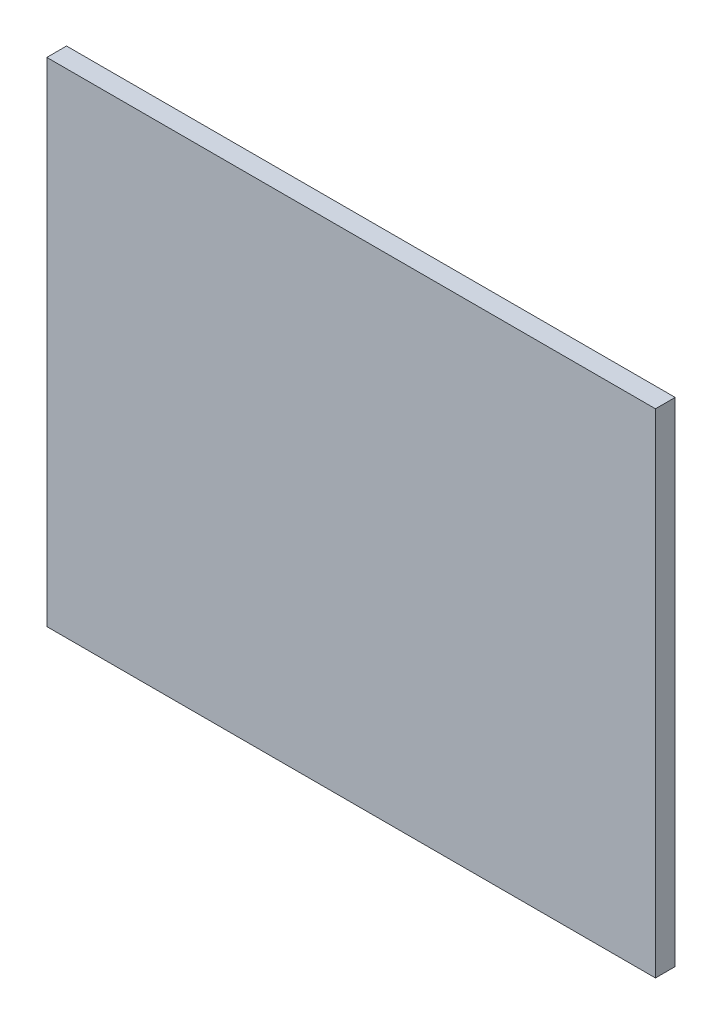
ISO-10303-21;
HEADER;
FILE_DESCRIPTION(('STEP AP214'),'2;1');
FILE_NAME('part.step','',(''),(''),'','','');
FILE_SCHEMA(('AUTOMOTIVE_DESIGN { 1 0 10303 214 1 1 1 1 }'));
ENDSEC;
DATA;
#1=APPLICATION_CONTEXT('core data for automotive mechanical design processes');
#2=APPLICATION_PROTOCOL_DEFINITION('international standard','automotive_design',2000,#1);
#3=PRODUCT_CONTEXT('',#1,'mechanical');
#4=PRODUCT('Part','Part','',(#3));
#5=PRODUCT_RELATED_PRODUCT_CATEGORY('part','',(#4));
#6=PRODUCT_DEFINITION_FORMATION('','',#4);
#7=PRODUCT_DEFINITION_CONTEXT('part definition',#1,'design');
#8=PRODUCT_DEFINITION('design','',#6,#7);
#9=PRODUCT_DEFINITION_SHAPE('','',#8);
#10=(LENGTH_UNIT() NAMED_UNIT(*) SI_UNIT(.MILLI.,.METRE.));
#11=(NAMED_UNIT(*) PLANE_ANGLE_UNIT() SI_UNIT($,.RADIAN.));
#12=(NAMED_UNIT(*) SI_UNIT($,.STERADIAN.) SOLID_ANGLE_UNIT());
#13=UNCERTAINTY_MEASURE_WITH_UNIT(LENGTH_MEASURE(1.E-05),#10,'distance_accuracy_value','');
#14=(GEOMETRIC_REPRESENTATION_CONTEXT(3) GLOBAL_UNCERTAINTY_ASSIGNED_CONTEXT((#13)) GLOBAL_UNIT_ASSIGNED_CONTEXT((#10,
#11,#12)) REPRESENTATION_CONTEXT('',''));
#15=CARTESIAN_POINT('',(0.,0.,0.));
#16=DIRECTION('',(0.,0.,1.));
#17=DIRECTION('',(1.,0.,0.));
#18=AXIS2_PLACEMENT_3D('',#15,#16,#17);
#19=CARTESIAN_POINT('',(-19.2882891651094,18.3076374413829,1.5));
#20=DIRECTION('',(1.,0.,0.));
#21=DIRECTION('',(0.,1.,0.));
#22=AXIS2_PLACEMENT_3D('',#19,#20,#21);
#23=PLANE('',#22);
#24=DIRECTION('',(0.,-1.,0.));
#25=VECTOR('',#24,1.);
#26=CARTESIAN_POINT('',(-19.2882891651094,18.3076374413829,0.));
#27=LINE('',#26,#25);
#28=CARTESIAN_POINT('',(-19.2882891651094,18.3076374413829,0.));
#29=VERTEX_POINT('',#28);
#30=CARTESIAN_POINT('',(-19.2882891651094,-19.1923625586171,0.));
#31=VERTEX_POINT('',#30);
#32=EDGE_CURVE('E98',#29,#31,#27,.T.);
#33=ORIENTED_EDGE('',*,*,#32,.T.);
#34=DIRECTION('',(0.,0.,-1.));
#35=VECTOR('',#34,1.);
#36=CARTESIAN_POINT('',(-19.2882891651094,-19.1923625586171,1.5));
#37=LINE('',#36,#35);
#38=CARTESIAN_POINT('',(-19.2882891651094,-19.1923625586171,1.5));
#39=VERTEX_POINT('',#38);
#40=EDGE_CURVE('E11',#39,#31,#37,.T.);
#41=ORIENTED_EDGE('',*,*,#40,.F.);
#42=DIRECTION('',(0.,-1.,0.));
#43=VECTOR('',#42,1.);
#44=CARTESIAN_POINT('',(-19.2882891651094,18.3076374413829,1.5));
#45=LINE('',#44,#43);
#46=CARTESIAN_POINT('',(-19.2882891651094,18.3076374413829,1.5));
#47=VERTEX_POINT('',#46);
#48=EDGE_CURVE('E86',#47,#39,#45,.T.);
#49=ORIENTED_EDGE('',*,*,#48,.F.);
#50=DIRECTION('',(0.,0.,-1.));
#51=VECTOR('',#50,1.);
#52=CARTESIAN_POINT('',(-19.2882891651094,18.3076374413829,1.5));
#53=LINE('',#52,#51);
#54=EDGE_CURVE('E94',#47,#29,#53,.T.);
#55=ORIENTED_EDGE('',*,*,#54,.T.);
#56=EDGE_LOOP('',(#33,#41,#49,#55));
#57=FACE_BOUND('',#56,.T.);
#58=ADVANCED_FACE('F35',(#57),#23,.F.);
#59=CARTESIAN_POINT('',(-19.2882891651094,-19.1923625586171,1.5));
#60=DIRECTION('',(0.,1.,0.));
#61=DIRECTION('',(-1.,0.,0.));
#62=AXIS2_PLACEMENT_3D('',#59,#60,#61);
#63=PLANE('',#62);
#64=DIRECTION('',(1.,0.,0.));
#65=VECTOR('',#64,1.);
#66=CARTESIAN_POINT('',(-19.2882891651094,-19.1923625586171,0.));
#67=LINE('',#66,#65);
#68=CARTESIAN_POINT('',(27.0117108348906,-19.1923625586171,0.));
#69=VERTEX_POINT('',#68);
#70=EDGE_CURVE('E90',#31,#69,#67,.T.);
#71=ORIENTED_EDGE('',*,*,#70,.T.);
#72=DIRECTION('',(0.,0.,-1.));
#73=VECTOR('',#72,1.);
#74=CARTESIAN_POINT('',(27.0117108348906,-19.1923625586171,1.5));
#75=LINE('',#74,#73);
#76=CARTESIAN_POINT('',(27.0117108348906,-19.1923625586171,1.5));
#77=VERTEX_POINT('',#76);
#78=EDGE_CURVE('E43',#77,#69,#75,.T.);
#79=ORIENTED_EDGE('',*,*,#78,.F.);
#80=DIRECTION('',(1.,0.,0.));
#81=VECTOR('',#80,1.);
#82=CARTESIAN_POINT('',(-19.2882891651094,-19.1923625586171,1.5));
#83=LINE('',#82,#81);
#84=EDGE_CURVE('E81',#39,#77,#83,.T.);
#85=ORIENTED_EDGE('',*,*,#84,.F.);
#86=ORIENTED_EDGE('',*,*,#40,.T.);
#87=EDGE_LOOP('',(#71,#79,#85,#86));
#88=FACE_BOUND('',#87,.T.);
#89=ADVANCED_FACE('F89',(#88),#63,.F.);
#90=CARTESIAN_POINT('',(27.0117108348906,18.3076374413829,1.5));
#91=DIRECTION('',(-1.,0.,0.));
#92=DIRECTION('',(0.,0.,1.));
#93=AXIS2_PLACEMENT_3D('',#90,#91,#92);
#94=PLANE('',#93);
#95=DIRECTION('',(0.,1.,0.));
#96=VECTOR('',#95,1.);
#97=CARTESIAN_POINT('',(27.0117108348906,18.3076374413829,0.));
#98=LINE('',#97,#96);
#99=CARTESIAN_POINT('',(27.0117108348906,18.3076374413829,0.));
#100=VERTEX_POINT('',#99);
#101=EDGE_CURVE('E68',#69,#100,#98,.T.);
#102=ORIENTED_EDGE('',*,*,#101,.T.);
#103=DIRECTION('',(0.,0.,-1.));
#104=VECTOR('',#103,1.);
#105=CARTESIAN_POINT('',(27.0117108348906,18.3076374413829,1.5));
#106=LINE('',#105,#104);
#107=CARTESIAN_POINT('',(27.0117108348906,18.3076374413829,1.5));
#108=VERTEX_POINT('',#107);
#109=EDGE_CURVE('E91',#108,#100,#106,.T.);
#110=ORIENTED_EDGE('',*,*,#109,.F.);
#111=DIRECTION('',(0.,1.,0.));
#112=VECTOR('',#111,1.);
#113=CARTESIAN_POINT('',(27.0117108348906,18.3076374413829,1.5));
#114=LINE('',#113,#112);
#115=EDGE_CURVE('E84',#77,#108,#114,.T.);
#116=ORIENTED_EDGE('',*,*,#115,.F.);
#117=ORIENTED_EDGE('',*,*,#78,.T.);
#118=EDGE_LOOP('',(#102,#110,#116,#117));
#119=FACE_BOUND('',#118,.T.);
#120=ADVANCED_FACE('F92',(#119),#94,.F.);
#121=CARTESIAN_POINT('',(-19.2882891651094,18.3076374413829,1.5));
#122=DIRECTION('',(0.,-1.,0.));
#123=DIRECTION('',(0.,0.,-1.));
#124=AXIS2_PLACEMENT_3D('',#121,#122,#123);
#125=PLANE('',#124);
#126=DIRECTION('',(-1.,0.,0.));
#127=VECTOR('',#126,1.);
#128=CARTESIAN_POINT('',(-19.2882891651094,18.3076374413829,0.));
#129=LINE('',#128,#127);
#130=EDGE_CURVE('E74',#100,#29,#129,.T.);
#131=ORIENTED_EDGE('',*,*,#130,.T.);
#132=ORIENTED_EDGE('',*,*,#54,.F.);
#133=DIRECTION('',(-1.,0.,0.));
#134=VECTOR('',#133,1.);
#135=CARTESIAN_POINT('',(-19.2882891651094,18.3076374413829,1.5));
#136=LINE('',#135,#134);
#137=EDGE_CURVE('E51',#108,#47,#136,.T.);
#138=ORIENTED_EDGE('',*,*,#137,.F.);
#139=ORIENTED_EDGE('',*,*,#109,.T.);
#140=EDGE_LOOP('',(#131,#132,#138,#139));
#141=FACE_BOUND('',#140,.T.);
#142=ADVANCED_FACE('F105',(#141),#125,.F.);
#143=CARTESIAN_POINT('',(0.,0.,1.5));
#144=DIRECTION('',(0.,0.,1.));
#145=DIRECTION('',(1.,0.,0.));
#146=AXIS2_PLACEMENT_3D('',#143,#144,#145);
#147=PLANE('',#146);
#148=ORIENTED_EDGE('',*,*,#48,.T.);
#149=ORIENTED_EDGE('',*,*,#84,.T.);
#150=ORIENTED_EDGE('',*,*,#115,.T.);
#151=ORIENTED_EDGE('',*,*,#137,.T.);
#152=EDGE_LOOP('',(#148,#149,#150,#151));
#153=FACE_BOUND('',#152,.T.);
#154=ADVANCED_FACE('F82',(#153),#147,.T.);
#155=CARTESIAN_POINT('',(0.,0.,0.));
#156=DIRECTION('',(0.,0.,1.));
#157=DIRECTION('',(1.,0.,0.));
#158=AXIS2_PLACEMENT_3D('',#155,#156,#157);
#159=PLANE('',#158);
#160=ORIENTED_EDGE('',*,*,#32,.F.);
#161=ORIENTED_EDGE('',*,*,#130,.F.);
#162=ORIENTED_EDGE('',*,*,#101,.F.);
#163=ORIENTED_EDGE('',*,*,#70,.F.);
#164=EDGE_LOOP('',(#160,#161,#162,#163));
#165=FACE_BOUND('',#164,.T.);
#166=ADVANCED_FACE('F108',(#165),#159,.F.);
#167=CLOSED_SHELL('',(#58,#89,#120,#142,#154,#166));
#168=MANIFOLD_SOLID_BREP('B2',#167);
#169=ADVANCED_BREP_SHAPE_REPRESENTATION('',(#18,#168),#14);
#170=SHAPE_DEFINITION_REPRESENTATION(#9,#169);
ENDSEC;
END-ISO-10303-21;
